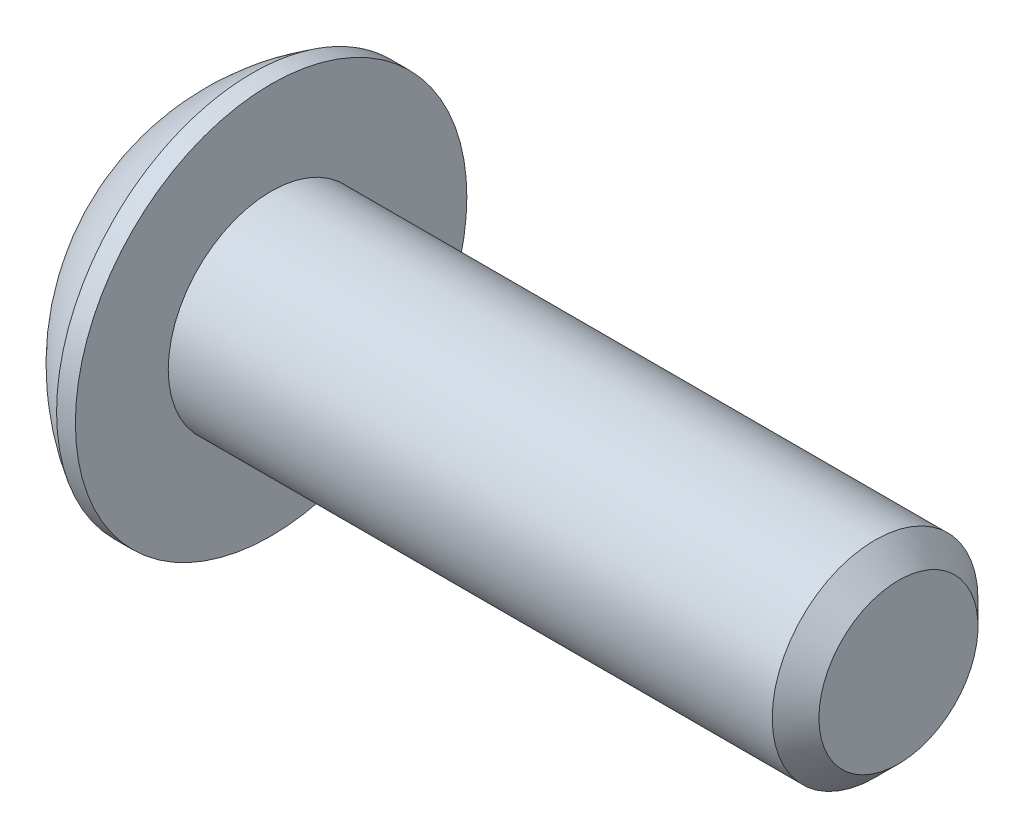
ISO-10303-21;
HEADER;
FILE_DESCRIPTION(('STEP AP214'),'2;1');
FILE_NAME('part.step','',(''),(''),'','','');
FILE_SCHEMA(('AUTOMOTIVE_DESIGN { 1 0 10303 214 1 1 1 1 }'));
ENDSEC;
DATA;
#1=APPLICATION_CONTEXT('core data for automotive mechanical design processes');
#2=APPLICATION_PROTOCOL_DEFINITION('international standard','automotive_design',2000,#1);
#3=PRODUCT_CONTEXT('',#1,'mechanical');
#4=PRODUCT('Part','Part','',(#3));
#5=PRODUCT_RELATED_PRODUCT_CATEGORY('part','',(#4));
#6=PRODUCT_DEFINITION_FORMATION('','',#4);
#7=PRODUCT_DEFINITION_CONTEXT('part definition',#1,'design');
#8=PRODUCT_DEFINITION('design','',#6,#7);
#9=PRODUCT_DEFINITION_SHAPE('','',#8);
#10=(LENGTH_UNIT() NAMED_UNIT(*) SI_UNIT(.MILLI.,.METRE.));
#11=(NAMED_UNIT(*) PLANE_ANGLE_UNIT() SI_UNIT($,.RADIAN.));
#12=(NAMED_UNIT(*) SI_UNIT($,.STERADIAN.) SOLID_ANGLE_UNIT());
#13=UNCERTAINTY_MEASURE_WITH_UNIT(LENGTH_MEASURE(1.E-05),#10,'distance_accuracy_value','');
#14=(GEOMETRIC_REPRESENTATION_CONTEXT(3) GLOBAL_UNCERTAINTY_ASSIGNED_CONTEXT((#13)) GLOBAL_UNIT_ASSIGNED_CONTEXT((#10,
#11,#12)) REPRESENTATION_CONTEXT('',''));
#15=CARTESIAN_POINT('',(0.,0.,0.));
#16=DIRECTION('',(0.,0.,1.));
#17=DIRECTION('',(1.,0.,0.));
#18=AXIS2_PLACEMENT_3D('',#15,#16,#17);
#19=CARTESIAN_POINT('',(1.32080000000034,0.,0.));
#20=DIRECTION('',(-1.,0.,0.));
#21=DIRECTION('',(0.,0.,1.));
#22=AXIS2_PLACEMENT_3D('',#19,#20,#21);
#23=CONICAL_SURFACE('',#22,1.1937999999998,1.04719755119608);
#24=CARTESIAN_POINT('',(2.01004075135902,0.,4.44089209850063E-13));
#25=VERTEX_POINT('',#24);
#26=VERTEX_LOOP('',#25);
#27=FACE_BOUND('',#26,.T.);
#28=CARTESIAN_POINT('',(1.32080000000009,0.,0.));
#29=DIRECTION('',(-1.,0.,0.));
#30=DIRECTION('',(0.,0.,1.));
#31=AXIS2_PLACEMENT_3D('',#28,#29,#30);
#32=CIRCLE('',#31,1.19380000000024);
#33=CARTESIAN_POINT('',(1.32080000000004,-1.03386112703797,0.59690000000006));
#34=VERTEX_POINT('',#33);
#35=CARTESIAN_POINT('',(1.32080000000004,0.,1.19380000000012));
#36=VERTEX_POINT('',#35);
#37=EDGE_CURVE('E19',#34,#36,#32,.T.);
#38=ORIENTED_EDGE('',*,*,#37,.T.);
#39=CARTESIAN_POINT('',(1.32080000000009,0.,0.));
#40=DIRECTION('',(-1.,0.,0.));
#41=DIRECTION('',(0.,0.,1.));
#42=AXIS2_PLACEMENT_3D('',#39,#40,#41);
#43=CIRCLE('',#42,1.19380000000024);
#44=CARTESIAN_POINT('',(1.32080000000004,1.03386112703797,0.596900000000061));
#45=VERTEX_POINT('',#44);
#46=EDGE_CURVE('E148',#36,#45,#43,.T.);
#47=ORIENTED_EDGE('',*,*,#46,.T.);
#48=CARTESIAN_POINT('',(1.32080000000009,0.,0.));
#49=DIRECTION('',(-1.,0.,0.));
#50=DIRECTION('',(0.,0.,1.));
#51=AXIS2_PLACEMENT_3D('',#48,#49,#50);
#52=CIRCLE('',#51,1.19380000000024);
#53=CARTESIAN_POINT('',(1.32080000000004,1.03386112703797,-0.596900000000061));
#54=VERTEX_POINT('',#53);
#55=EDGE_CURVE('E476',#45,#54,#52,.T.);
#56=ORIENTED_EDGE('',*,*,#55,.T.);
#57=CARTESIAN_POINT('',(1.32080000000009,0.,0.));
#58=DIRECTION('',(-1.,0.,0.));
#59=DIRECTION('',(0.,0.,1.));
#60=AXIS2_PLACEMENT_3D('',#57,#58,#59);
#61=CIRCLE('',#60,1.19380000000024);
#62=CARTESIAN_POINT('',(1.32080000000004,1.49457637585666E-12,-1.19380000000012));
#63=VERTEX_POINT('',#62);
#64=EDGE_CURVE('E477',#54,#63,#61,.T.);
#65=ORIENTED_EDGE('',*,*,#64,.T.);
#66=CARTESIAN_POINT('',(1.32080000000009,0.,0.));
#67=DIRECTION('',(-1.,0.,0.));
#68=DIRECTION('',(0.,0.,1.));
#69=AXIS2_PLACEMENT_3D('',#66,#67,#68);
#70=CIRCLE('',#69,1.19380000000024);
#71=CARTESIAN_POINT('',(1.32080000000004,-1.03386112703797,-0.59690000000006));
#72=VERTEX_POINT('',#71);
#73=EDGE_CURVE('E92',#63,#72,#70,.T.);
#74=ORIENTED_EDGE('',*,*,#73,.T.);
#75=CARTESIAN_POINT('',(1.32080000000009,0.,0.));
#76=DIRECTION('',(-1.,0.,0.));
#77=DIRECTION('',(0.,0.,1.));
#78=AXIS2_PLACEMENT_3D('',#75,#76,#77);
#79=CIRCLE('',#78,1.19380000000024);
#80=EDGE_CURVE('E88',#72,#34,#79,.T.);
#81=ORIENTED_EDGE('',*,*,#80,.T.);
#82=EDGE_LOOP('',(#38,#47,#56,#65,#74,#81));
#83=FACE_BOUND('',#82,.T.);
#84=ADVANCED_FACE('F16',(#27,#83),#23,.F.);
#85=CARTESIAN_POINT('',(1.3208,-2.06772225407572,-1.1938));
#86=DIRECTION('',(1.,0.,0.));
#87=DIRECTION('',(0.,0.,-1.));
#88=AXIS2_PLACEMENT_3D('',#85,#86,#87);
#89=PLANE('',#88);
#90=DIRECTION('',(0.,0.5,0.866025403784439));
#91=VECTOR('',#90,1.);
#92=CARTESIAN_POINT('',(1.3208,-1.37848150271715,0.));
#93=LINE('',#92,#91);
#94=CARTESIAN_POINT('',(1.3208,-0.689240751358574,1.1938));
#95=VERTEX_POINT('',#94);
#96=EDGE_CURVE('E100',#95,#34,#93,.F.);
#97=ORIENTED_EDGE('',*,*,#96,.F.);
#98=DIRECTION('',(0.,1.,0.));
#99=VECTOR('',#98,1.);
#100=CARTESIAN_POINT('',(1.3208,-0.689240751358574,1.1938));
#101=LINE('',#100,#99);
#102=EDGE_CURVE('E102',#36,#95,#101,.F.);
#103=ORIENTED_EDGE('',*,*,#102,.F.);
#104=ORIENTED_EDGE('',*,*,#37,.F.);
#105=EDGE_LOOP('',(#97,#103,#104));
#106=FACE_BOUND('',#105,.T.);
#107=ADVANCED_FACE('F98',(#106),#89,.F.);
#108=CARTESIAN_POINT('',(1.3208,-2.06772225407572,-1.1938));
#109=DIRECTION('',(1.,0.,0.));
#110=DIRECTION('',(0.,0.,-1.));
#111=AXIS2_PLACEMENT_3D('',#108,#109,#110);
#112=PLANE('',#111);
#113=DIRECTION('',(0.,-0.5,0.866025403784439));
#114=VECTOR('',#113,1.);
#115=CARTESIAN_POINT('',(1.3208,-0.689240751358574,-1.1938));
#116=LINE('',#115,#114);
#117=CARTESIAN_POINT('',(1.3208,-1.37848150271715,0.));
#118=VERTEX_POINT('',#117);
#119=EDGE_CURVE('E108',#118,#72,#116,.F.);
#120=ORIENTED_EDGE('',*,*,#119,.F.);
#121=DIRECTION('',(0.,0.5,0.866025403784439));
#122=VECTOR('',#121,1.);
#123=CARTESIAN_POINT('',(1.3208,-1.37848150271715,0.));
#124=LINE('',#123,#122);
#125=EDGE_CURVE('E105',#34,#118,#124,.F.);
#126=ORIENTED_EDGE('',*,*,#125,.F.);
#127=ORIENTED_EDGE('',*,*,#80,.F.);
#128=EDGE_LOOP('',(#120,#126,#127));
#129=FACE_BOUND('',#128,.T.);
#130=ADVANCED_FACE('F106',(#129),#112,.F.);
#131=CARTESIAN_POINT('',(1.3208,-2.06772225407572,-1.1938));
#132=DIRECTION('',(1.,0.,0.));
#133=DIRECTION('',(0.,0.,-1.));
#134=AXIS2_PLACEMENT_3D('',#131,#132,#133);
#135=PLANE('',#134);
#136=DIRECTION('',(0.,1.,0.));
#137=VECTOR('',#136,1.);
#138=CARTESIAN_POINT('',(1.3208,0.689240751358577,-1.1938));
#139=LINE('',#138,#137);
#140=CARTESIAN_POINT('',(1.3208,-0.689240751358574,-1.1938));
#141=VERTEX_POINT('',#140);
#142=EDGE_CURVE('E447',#141,#63,#139,.T.);
#143=ORIENTED_EDGE('',*,*,#142,.F.);
#144=DIRECTION('',(0.,-0.5,0.866025403784439));
#145=VECTOR('',#144,1.);
#146=CARTESIAN_POINT('',(1.3208,-0.689240751358574,-1.1938));
#147=LINE('',#146,#145);
#148=EDGE_CURVE('E459',#72,#141,#147,.F.);
#149=ORIENTED_EDGE('',*,*,#148,.F.);
#150=ORIENTED_EDGE('',*,*,#73,.F.);
#151=EDGE_LOOP('',(#143,#149,#150));
#152=FACE_BOUND('',#151,.T.);
#153=ADVANCED_FACE('F191',(#152),#135,.F.);
#154=CARTESIAN_POINT('',(1.3208,-2.06772225407572,-1.1938));
#155=DIRECTION('',(1.,0.,0.));
#156=DIRECTION('',(0.,0.,-1.));
#157=AXIS2_PLACEMENT_3D('',#154,#155,#156);
#158=PLANE('',#157);
#159=DIRECTION('',(0.,-0.5,-0.866025403784439));
#160=VECTOR('',#159,1.);
#161=CARTESIAN_POINT('',(1.3208,1.37848150271715,0.));
#162=LINE('',#161,#160);
#163=CARTESIAN_POINT('',(1.3208,0.689240751358577,-1.1938));
#164=VERTEX_POINT('',#163);
#165=EDGE_CURVE('E433',#164,#54,#162,.F.);
#166=ORIENTED_EDGE('',*,*,#165,.F.);
#167=DIRECTION('',(0.,1.,0.));
#168=VECTOR('',#167,1.);
#169=CARTESIAN_POINT('',(1.3208,0.689240751358577,-1.1938));
#170=LINE('',#169,#168);
#171=EDGE_CURVE('E444',#63,#164,#170,.T.);
#172=ORIENTED_EDGE('',*,*,#171,.F.);
#173=ORIENTED_EDGE('',*,*,#64,.F.);
#174=EDGE_LOOP('',(#166,#172,#173));
#175=FACE_BOUND('',#174,.T.);
#176=ADVANCED_FACE('F187',(#175),#158,.F.);
#177=CARTESIAN_POINT('',(1.3208,-2.06772225407572,-1.1938));
#178=DIRECTION('',(1.,0.,0.));
#179=DIRECTION('',(0.,0.,-1.));
#180=AXIS2_PLACEMENT_3D('',#177,#178,#179);
#181=PLANE('',#180);
#182=DIRECTION('',(0.,0.5,-0.866025403784439));
#183=VECTOR('',#182,1.);
#184=CARTESIAN_POINT('',(1.3208,0.689240751358576,1.1938));
#185=LINE('',#184,#183);
#186=CARTESIAN_POINT('',(1.3208,1.37848150271715,0.));
#187=VERTEX_POINT('',#186);
#188=EDGE_CURVE('E412',#187,#45,#185,.F.);
#189=ORIENTED_EDGE('',*,*,#188,.F.);
#190=DIRECTION('',(0.,-0.5,-0.866025403784439));
#191=VECTOR('',#190,1.);
#192=CARTESIAN_POINT('',(1.3208,1.37848150271715,0.));
#193=LINE('',#192,#191);
#194=EDGE_CURVE('E431',#54,#187,#193,.F.);
#195=ORIENTED_EDGE('',*,*,#194,.F.);
#196=ORIENTED_EDGE('',*,*,#55,.F.);
#197=EDGE_LOOP('',(#189,#195,#196));
#198=FACE_BOUND('',#197,.T.);
#199=ADVANCED_FACE('F183',(#198),#181,.F.);
#200=CARTESIAN_POINT('',(1.3208,-2.06772225407572,-1.1938));
#201=DIRECTION('',(1.,0.,0.));
#202=DIRECTION('',(0.,0.,-1.));
#203=AXIS2_PLACEMENT_3D('',#200,#201,#202);
#204=PLANE('',#203);
#205=DIRECTION('',(0.,1.,0.));
#206=VECTOR('',#205,1.);
#207=CARTESIAN_POINT('',(1.3208,-0.689240751358574,1.1938));
#208=LINE('',#207,#206);
#209=CARTESIAN_POINT('',(1.3208,0.689240751358576,1.1938));
#210=VERTEX_POINT('',#209);
#211=EDGE_CURVE('E117',#210,#36,#208,.F.);
#212=ORIENTED_EDGE('',*,*,#211,.F.);
#213=DIRECTION('',(0.,0.5,-0.866025403784439));
#214=VECTOR('',#213,1.);
#215=CARTESIAN_POINT('',(1.3208,0.689240751358576,1.1938));
#216=LINE('',#215,#214);
#217=EDGE_CURVE('E415',#45,#210,#216,.F.);
#218=ORIENTED_EDGE('',*,*,#217,.F.);
#219=ORIENTED_EDGE('',*,*,#46,.F.);
#220=EDGE_LOOP('',(#212,#218,#219));
#221=FACE_BOUND('',#220,.T.);
#222=ADVANCED_FACE('F179',(#221),#204,.F.);
#223=CARTESIAN_POINT('',(1.3208,-0.689240751358574,1.1938));
#224=DIRECTION('',(0.,0.,-1.));
#225=DIRECTION('',(0.,1.,0.));
#226=AXIS2_PLACEMENT_3D('',#223,#224,#225);
#227=PLANE('',#226);
#228=DIRECTION('',(0.,1.,0.));
#229=VECTOR('',#228,1.);
#230=CARTESIAN_POINT('',(0.,0.,1.1938));
#231=LINE('',#230,#229);
#232=CARTESIAN_POINT('',(0.,0.689240751358577,1.1938));
#233=VERTEX_POINT('',#232);
#234=CARTESIAN_POINT('',(0.,-0.689240751358574,1.1938));
#235=VERTEX_POINT('',#234);
#236=EDGE_CURVE('E409',#233,#235,#231,.F.);
#237=ORIENTED_EDGE('',*,*,#236,.F.);
#238=DIRECTION('',(1.,0.,0.));
#239=VECTOR('',#238,1.);
#240=CARTESIAN_POINT('',(1.3208,0.689240751358576,1.1938));
#241=LINE('',#240,#239);
#242=EDGE_CURVE('E421',#210,#233,#241,.F.);
#243=ORIENTED_EDGE('',*,*,#242,.F.);
#244=ORIENTED_EDGE('',*,*,#211,.T.);
#245=ORIENTED_EDGE('',*,*,#102,.T.);
#246=DIRECTION('',(1.,0.,0.));
#247=VECTOR('',#246,1.);
#248=CARTESIAN_POINT('',(1.3208,-0.689240751358574,1.1938));
#249=LINE('',#248,#247);
#250=EDGE_CURVE('E111',#235,#95,#249,.T.);
#251=ORIENTED_EDGE('',*,*,#250,.F.);
#252=EDGE_LOOP('',(#237,#243,#244,#245,#251));
#253=FACE_BOUND('',#252,.T.);
#254=ADVANCED_FACE('F176',(#253),#227,.T.);
#255=CARTESIAN_POINT('',(1.3208,-1.37848150271715,0.));
#256=DIRECTION('',(0.,0.866025403784439,-0.5));
#257=DIRECTION('',(0.,0.5,0.866025403784439));
#258=AXIS2_PLACEMENT_3D('',#255,#256,#257);
#259=PLANE('',#258);
#260=DIRECTION('',(0.,-0.5,-0.866025403784439));
#261=VECTOR('',#260,1.);
#262=CARTESIAN_POINT('',(0.,-0.689240751358574,1.1938));
#263=LINE('',#262,#261);
#264=CARTESIAN_POINT('',(0.,-1.37848150271715,0.));
#265=VERTEX_POINT('',#264);
#266=EDGE_CURVE('E406',#235,#265,#263,.T.);
#267=ORIENTED_EDGE('',*,*,#266,.F.);
#268=ORIENTED_EDGE('',*,*,#250,.T.);
#269=ORIENTED_EDGE('',*,*,#96,.T.);
#270=ORIENTED_EDGE('',*,*,#125,.T.);
#271=DIRECTION('',(1.,0.,0.));
#272=VECTOR('',#271,1.);
#273=CARTESIAN_POINT('',(1.3208,-1.37848150271715,0.));
#274=LINE('',#273,#272);
#275=EDGE_CURVE('E456',#265,#118,#274,.T.);
#276=ORIENTED_EDGE('',*,*,#275,.F.);
#277=EDGE_LOOP('',(#267,#268,#269,#270,#276));
#278=FACE_BOUND('',#277,.T.);
#279=ADVANCED_FACE('F115',(#278),#259,.T.);
#280=CARTESIAN_POINT('',(1.3208,-0.689240751358574,-1.1938));
#281=DIRECTION('',(0.,0.866025403784439,0.5));
#282=DIRECTION('',(0.,-0.5,0.866025403784439));
#283=AXIS2_PLACEMENT_3D('',#280,#281,#282);
#284=PLANE('',#283);
#285=DIRECTION('',(0.,0.5,-0.866025403784439));
#286=VECTOR('',#285,1.);
#287=CARTESIAN_POINT('',(0.,-1.37848150271715,0.));
#288=LINE('',#287,#286);
#289=CARTESIAN_POINT('',(0.,-0.689240751358574,-1.1938));
#290=VERTEX_POINT('',#289);
#291=EDGE_CURVE('E403',#265,#290,#288,.T.);
#292=ORIENTED_EDGE('',*,*,#291,.F.);
#293=ORIENTED_EDGE('',*,*,#275,.T.);
#294=ORIENTED_EDGE('',*,*,#119,.T.);
#295=ORIENTED_EDGE('',*,*,#148,.T.);
#296=DIRECTION('',(1.,0.,0.));
#297=VECTOR('',#296,1.);
#298=CARTESIAN_POINT('',(1.3208,-0.689240751358574,-1.1938));
#299=LINE('',#298,#297);
#300=EDGE_CURVE('E441',#290,#141,#299,.T.);
#301=ORIENTED_EDGE('',*,*,#300,.F.);
#302=EDGE_LOOP('',(#292,#293,#294,#295,#301));
#303=FACE_BOUND('',#302,.T.);
#304=ADVANCED_FACE('F169',(#303),#284,.T.);
#305=CARTESIAN_POINT('',(1.3208,0.689240751358577,-1.1938));
#306=DIRECTION('',(0.,0.,1.));
#307=DIRECTION('',(1.,0.,0.));
#308=AXIS2_PLACEMENT_3D('',#305,#306,#307);
#309=PLANE('',#308);
#310=DIRECTION('',(0.,1.,0.));
#311=VECTOR('',#310,1.);
#312=CARTESIAN_POINT('',(0.,0.,-1.1938));
#313=LINE('',#312,#311);
#314=CARTESIAN_POINT('',(0.,0.689240751358577,-1.1938));
#315=VERTEX_POINT('',#314);
#316=EDGE_CURVE('E400',#290,#315,#313,.T.);
#317=ORIENTED_EDGE('',*,*,#316,.F.);
#318=ORIENTED_EDGE('',*,*,#300,.T.);
#319=ORIENTED_EDGE('',*,*,#142,.T.);
#320=ORIENTED_EDGE('',*,*,#171,.T.);
#321=DIRECTION('',(1.,0.,0.));
#322=VECTOR('',#321,1.);
#323=CARTESIAN_POINT('',(1.3208,0.689240751358577,-1.1938));
#324=LINE('',#323,#322);
#325=EDGE_CURVE('E416',#315,#164,#324,.T.);
#326=ORIENTED_EDGE('',*,*,#325,.F.);
#327=EDGE_LOOP('',(#317,#318,#319,#320,#326));
#328=FACE_BOUND('',#327,.T.);
#329=ADVANCED_FACE('F166',(#328),#309,.T.);
#330=CARTESIAN_POINT('',(1.3208,1.37848150271715,0.));
#331=DIRECTION('',(0.,-0.866025403784439,0.5));
#332=DIRECTION('',(0.,-0.5,-0.866025403784439));
#333=AXIS2_PLACEMENT_3D('',#330,#331,#332);
#334=PLANE('',#333);
#335=DIRECTION('',(0.,0.5,0.866025403784439));
#336=VECTOR('',#335,1.);
#337=CARTESIAN_POINT('',(0.,0.689240751358577,-1.1938));
#338=LINE('',#337,#336);
#339=CARTESIAN_POINT('',(0.,1.37848150271715,0.));
#340=VERTEX_POINT('',#339);
#341=EDGE_CURVE('E397',#315,#340,#338,.T.);
#342=ORIENTED_EDGE('',*,*,#341,.F.);
#343=ORIENTED_EDGE('',*,*,#325,.T.);
#344=ORIENTED_EDGE('',*,*,#165,.T.);
#345=ORIENTED_EDGE('',*,*,#194,.T.);
#346=DIRECTION('',(1.,0.,0.));
#347=VECTOR('',#346,1.);
#348=CARTESIAN_POINT('',(1.3208,1.37848150271715,0.));
#349=LINE('',#348,#347);
#350=EDGE_CURVE('E34',#340,#187,#349,.T.);
#351=ORIENTED_EDGE('',*,*,#350,.F.);
#352=EDGE_LOOP('',(#342,#343,#344,#345,#351));
#353=FACE_BOUND('',#352,.T.);
#354=ADVANCED_FACE('F162',(#353),#334,.T.);
#355=CARTESIAN_POINT('',(1.3208,0.689240751358576,1.1938));
#356=DIRECTION('',(0.,-0.866025403784439,-0.5));
#357=DIRECTION('',(0.,0.5,-0.866025403784439));
#358=AXIS2_PLACEMENT_3D('',#355,#356,#357);
#359=PLANE('',#358);
#360=DIRECTION('',(0.,-0.5,0.866025403784439));
#361=VECTOR('',#360,1.);
#362=CARTESIAN_POINT('',(0.,1.37848150271715,0.));
#363=LINE('',#362,#361);
#364=EDGE_CURVE('E147',#340,#233,#363,.T.);
#365=ORIENTED_EDGE('',*,*,#364,.F.);
#366=ORIENTED_EDGE('',*,*,#350,.T.);
#367=ORIENTED_EDGE('',*,*,#188,.T.);
#368=ORIENTED_EDGE('',*,*,#217,.T.);
#369=ORIENTED_EDGE('',*,*,#242,.T.);
#370=EDGE_LOOP('',(#365,#366,#367,#368,#369));
#371=FACE_BOUND('',#370,.T.);
#372=ADVANCED_FACE('F158',(#371),#359,.T.);
#373=CARTESIAN_POINT('',(0.,0.,0.));
#374=DIRECTION('',(-1.,0.,0.));
#375=DIRECTION('',(0.,0.,1.));
#376=AXIS2_PLACEMENT_3D('',#373,#374,#375);
#377=PLANE('',#376);
#378=ORIENTED_EDGE('',*,*,#341,.T.);
#379=ORIENTED_EDGE('',*,*,#364,.T.);
#380=ORIENTED_EDGE('',*,*,#236,.T.);
#381=ORIENTED_EDGE('',*,*,#266,.T.);
#382=ORIENTED_EDGE('',*,*,#291,.T.);
#383=ORIENTED_EDGE('',*,*,#316,.T.);
#384=EDGE_LOOP('',(#378,#379,#380,#381,#382,#383));
#385=FACE_BOUND('',#384,.T.);
#386=CARTESIAN_POINT('',(0.,1.9812,0.));
#387=CARTESIAN_POINT('',(0.,1.9811996664299,0.0556258831179428));
#388=CARTESIAN_POINT('',(0.,1.97885520380442,0.111261989398606));
#389=CARTESIAN_POINT('',(0.,1.96949260169541,0.222149719830458));
#390=CARTESIAN_POINT('',(0.,1.96247308239605,0.277401225602895));
#391=CARTESIAN_POINT('',(0.,1.94379192841038,0.387209508139747));
#392=CARTESIAN_POINT('',(-1.85325793235264E-13,1.93212292489526,0.441765039546365));
#393=CARTESIAN_POINT('',(1.86344214223505E-13,1.90422331175315,0.549729449347493));
#394=CARTESIAN_POINT('',(6.94543371897454E-13,1.88798900035338,0.603137359208869));
#395=CARTESIAN_POINT('',(1.15501975216981E-12,1.83266214476501,0.760839131321828));
#396=CARTESIAN_POINT('',(0.,1.78690023648845,0.862876433575429));
#397=CARTESIAN_POINT('',(0.,1.67887358150667,1.05780719540872));
#398=CARTESIAN_POINT('',(9.54193214892627E-13,1.6166082074585,1.15070030720801));
#399=CARTESIAN_POINT('',(5.94805591894675E-13,1.51224157140982,1.28116890915697));
#400=CARTESIAN_POINT('',(1.63221293851378E-13,1.4755970394354,1.32320451127026));
#401=CARTESIAN_POINT('',(-1.62196980336157E-13,1.39893832619713,1.40400288695709));
#402=CARTESIAN_POINT('',(0.,1.35892742784698,1.44276877695455));
#403=CARTESIAN_POINT('',(1.14362537325405E-13,1.23416504602197,1.55382272417904));
#404=CARTESIAN_POINT('',(0.,1.14466125559859,1.62089527952111));
#405=CARTESIAN_POINT('',(0.,0.955712144178167,1.7390221808118));
#406=CARTESIAN_POINT('',(0.,0.856267198233564,1.79007713076007));
#407=CARTESIAN_POINT('',(0.,0.650206345910843,1.87477637530954));
#408=CARTESIAN_POINT('',(0.,0.543590516134855,1.90842085586267));
#409=CARTESIAN_POINT('',(0.,0.326226155292018,1.95733039300656));
#410=CARTESIAN_POINT('',(0.,0.21547760215793,1.97259535144288));
#411=CARTESIAN_POINT('',(0.,-0.00701040587544639,1.98431697865418));
#412=CARTESIAN_POINT('',(0.,-0.118749860774734,1.98077364742917));
#413=CARTESIAN_POINT('',(0.,-0.340050178355485,1.95497485623825));
#414=CARTESIAN_POINT('',(0.,-0.449611052668255,1.93271949620218));
#415=CARTESIAN_POINT('',(0.,-0.663431110729174,1.87014138774523));
#416=CARTESIAN_POINT('',(0.,-0.76769023783852,1.82981844635272));
#417=CARTESIAN_POINT('',(0.,-0.968005760719347,1.73219968377096));
#418=CARTESIAN_POINT('',(0.,-1.0640618469811,1.6749032225164));
#419=CARTESIAN_POINT('',(0.,-1.19980276751283,1.57757371205873));
#420=CARTESIAN_POINT('',(0.,-1.24366557129213,1.54322665019466));
#421=CARTESIAN_POINT('',(0.,-1.32838995706696,1.47093063174264));
#422=CARTESIAN_POINT('',(0.,-1.36924860178706,1.43297823102439));
#423=CARTESIAN_POINT('',(0.,-1.48674671849223,1.31419842051173));
#424=CARTESIAN_POINT('',(0.,-1.55842832343237,1.22836221289311));
#425=CARTESIAN_POINT('',(0.,-1.6863396856475,1.04586168272493));
#426=CARTESIAN_POINT('',(0.,-1.7425700302488,0.949197771949774));
#427=CARTESIAN_POINT('',(0.,-1.8141614250401,0.798182600298684));
#428=CARTESIAN_POINT('',(0.,-1.83591780585875,0.746776203847791));
#429=CARTESIAN_POINT('',(0.,-1.87500754181092,0.642341081688636));
#430=CARTESIAN_POINT('',(0.,-1.89234447645404,0.589313708122847));
#431=CARTESIAN_POINT('',(0.,-1.92246053433554,0.482076273028395));
#432=CARTESIAN_POINT('',(0.,-1.93524685475118,0.42786822425751));
#433=CARTESIAN_POINT('',(0.,-1.95620937250494,0.318578151844611));
#434=CARTESIAN_POINT('',(0.,-1.96438692958147,0.263496390912872));
#435=CARTESIAN_POINT('',(0.,-1.97388528284653,0.173607715038558));
#436=CARTESIAN_POINT('',(0.,-1.97662743364426,0.138944718024998));
#437=CARTESIAN_POINT('',(0.,-1.98028489645283,0.0695224782567002));
#438=CARTESIAN_POINT('',(0.,-1.98120020846367,0.0347632355019631));
#439=CARTESIAN_POINT('',(0.,-1.9811996664299,-0.0556258831179437));
#440=CARTESIAN_POINT('',(0.,-1.97885520380442,-0.111261989398607));
#441=CARTESIAN_POINT('',(0.,-1.96949260169541,-0.222149719830459));
#442=CARTESIAN_POINT('',(0.,-1.96247308239605,-0.277401225602897));
#443=CARTESIAN_POINT('',(0.,-1.94379192841039,-0.387209508139749));
#444=CARTESIAN_POINT('',(-1.85269749640691E-13,-1.93212292489526,-0.441765039546367));
#445=CARTESIAN_POINT('',(1.86288125054388E-13,-1.90422331175315,-0.549729449347495));
#446=CARTESIAN_POINT('',(6.94525090263764E-13,-1.88798900035338,-0.603137359208872));
#447=CARTESIAN_POINT('',(1.15505622829081E-12,-1.83266214476501,-0.760839131321831));
#448=CARTESIAN_POINT('',(0.,-1.78690023648845,-0.862876433575431));
#449=CARTESIAN_POINT('',(0.,-1.67887358150667,-1.05780719540872));
#450=CARTESIAN_POINT('',(9.54248812869379E-13,-1.6166082074585,-1.15070030720801));
#451=CARTESIAN_POINT('',(5.94777756479239E-13,-1.51224157140982,-1.28116890915698));
#452=CARTESIAN_POINT('',(1.63138949183833E-13,-1.47559703943539,-1.32320451127027));
#453=CARTESIAN_POINT('',(-1.62114715061273E-13,-1.39893832619713,-1.40400288695709));
#454=CARTESIAN_POINT('',(0.,-1.35892742784699,-1.44276877695455));
#455=CARTESIAN_POINT('',(1.13760489124207E-13,-1.23416504602197,-1.55382272417904));
#456=CARTESIAN_POINT('',(0.,-1.14466125559859,-1.62089527952111));
#457=CARTESIAN_POINT('',(0.,-0.95571214417816,-1.73902218081179));
#458=CARTESIAN_POINT('',(0.,-0.856267198233559,-1.79007713076007));
#459=CARTESIAN_POINT('',(0.,-0.650206345910841,-1.87477637530954));
#460=CARTESIAN_POINT('',(0.,-0.543590516134854,-1.90842085586267));
#461=CARTESIAN_POINT('',(0.,-0.326226155292018,-1.95733039300657));
#462=CARTESIAN_POINT('',(0.,-0.215477602157929,-1.97259535144288));
#463=CARTESIAN_POINT('',(0.,0.0070104058754487,-1.98431697865418));
#464=CARTESIAN_POINT('',(0.,0.118749860774737,-1.98077364742916));
#465=CARTESIAN_POINT('',(0.,0.340050178355489,-1.95497485623824));
#466=CARTESIAN_POINT('',(0.,0.44961105266826,-1.93271949620218));
#467=CARTESIAN_POINT('',(0.,0.663431110729178,-1.87014138774524));
#468=CARTESIAN_POINT('',(0.,0.767690237838524,-1.82981844635272));
#469=CARTESIAN_POINT('',(0.,0.968005760719348,-1.73219968377096));
#470=CARTESIAN_POINT('',(0.,1.0640618469811,-1.67490322251639));
#471=CARTESIAN_POINT('',(0.,1.19980276751283,-1.57757371205873));
#472=CARTESIAN_POINT('',(0.,1.24366557129214,-1.54322665019465));
#473=CARTESIAN_POINT('',(0.,1.32838995706696,-1.47093063174263));
#474=CARTESIAN_POINT('',(0.,1.36924860178706,-1.43297823102439));
#475=CARTESIAN_POINT('',(0.,1.48674671849223,-1.31419842051172));
#476=CARTESIAN_POINT('',(0.,1.55842832343237,-1.22836221289311));
#477=CARTESIAN_POINT('',(0.,1.6863396856475,-1.04586168272492));
#478=CARTESIAN_POINT('',(0.,1.7425700302488,-0.949197771949768));
#479=CARTESIAN_POINT('',(0.,1.8141614250401,-0.798182600298677));
#480=CARTESIAN_POINT('',(0.,1.83591780585875,-0.746776203847785));
#481=CARTESIAN_POINT('',(0.,1.87500754181092,-0.64234108168863));
#482=CARTESIAN_POINT('',(0.,1.89234447645404,-0.589313708122841));
#483=CARTESIAN_POINT('',(0.,1.92246053433555,-0.482076273028389));
#484=CARTESIAN_POINT('',(0.,1.93524685475118,-0.427868224257505));
#485=CARTESIAN_POINT('',(0.,1.95620937250494,-0.318578151844605));
#486=CARTESIAN_POINT('',(0.,1.96438692958147,-0.263496390912866));
#487=CARTESIAN_POINT('',(0.,1.97388528284653,-0.173607715038553));
#488=CARTESIAN_POINT('',(0.,1.97662743364426,-0.138944718024994));
#489=CARTESIAN_POINT('',(0.,1.98028489645283,-0.0695224782566989));
#490=CARTESIAN_POINT('',(0.,1.98120020846367,-0.034763235501963));
#491=CARTESIAN_POINT('',(0.,1.9812,0.));
#492=B_SPLINE_CURVE_WITH_KNOTS('',3,(#386,#387,#388,#389,#390,#391,#392,#393,#394,#395,#396,
#397,#398,#399,#400,#401,#402,#403,#404,#405,#406,#407,#408,#409,#410,#411,#412,#413,#414,#415,
#416,#417,#418,#419,#420,#421,#422,#423,#424,#425,#426,#427,#428,#429,#430,#431,#432,#433,#434,
#435,#436,#437,#438,#439,#440,#441,#442,#443,#444,#445,#446,#447,#448,#449,#450,#451,#452,#453,
#454,#455,#456,#457,#458,#459,#460,#461,#462,#463,#464,#465,#466,#467,#468,#469,#470,#471,#472,
#473,#474,#475,#476,#477,#478,#479,#480,#481,#482,#483,#484,#485,#486,#487,#488,#489,#490,#491),
.UNSPECIFIED.,.T.,.F.,(4,2,2,2,2,2,2,2,2,2,2,2,2,2,2,2,2,2,2,2,2,2,2,2,2,2,2,2,2,2,2,2,2,2,2,2,
2,2,2,2,2,2,2,2,2,2,2,2,2,2,2,2,4),(0.,0.166845646007828,0.333740557374255,0.500901034367693,
0.668197445942386,1.00199278686282,1.33580081809885,1.50292354032982,1.6698851310853,
2.00370118900129,2.33750465770544,2.67130456115909,3.005106247238,3.33890793331696,
3.67270783677065,4.00651130547476,4.34032736339026,4.50728895414554,4.67441167637632,
5.00821970761259,5.34201504853332,5.50931146010827,5.67647193710191,5.84336684846844,
6.0102124944764,6.11448220058334,6.21875190669029,6.38559755269812,6.55249246406454,
6.71965294105798,6.88694935263268,7.22074469355311,7.55455272478915,7.72167544702011,
7.88863703777559,8.22245309569158,8.55625656439573,8.89005646784938,9.2238581539283,
9.55765984000725,9.89145974346094,10.2252632121651,10.5590792700806,10.7260408608358,
10.8931635830666,11.2269716143029,11.5607669552236,11.7280633667986,11.8952238437922,
12.0621187551587,12.2289644011667,12.3332341072736,12.4375038133806),.UNSPECIFIED.);
#493=CARTESIAN_POINT('',(0.,1.9812,0.));
#494=VERTEX_POINT('',#493);
#495=EDGE_CURVE('E139',#494,#494,#492,.T.);
#496=ORIENTED_EDGE('',*,*,#495,.F.);
#497=EDGE_LOOP('',(#496));
#498=FACE_BOUND('',#497,.T.);
#499=ADVANCED_FACE('F154',(#385,#498),#377,.T.);
#500=CARTESIAN_POINT('',(4.13385,0.,0.));
#501=DIRECTION('',(0.,1.,0.));
#502=DIRECTION('',(1.,0.,0.));
#503=AXIS2_PLACEMENT_3D('',#500,#501,#502);
#504=SPHERICAL_SURFACE('',#503,4.58408870578439);
#505=CARTESIAN_POINT('',(1.8288,0.,0.));
#506=DIRECTION('',(-1.,0.,0.));
#507=DIRECTION('',(0.,0.,1.));
#508=AXIS2_PLACEMENT_3D('',#505,#506,#507);
#509=CIRCLE('',#508,3.9624);
#510=CARTESIAN_POINT('',(1.8288,0.,3.9624));
#511=VERTEX_POINT('',#510);
#512=EDGE_CURVE('E136',#511,#511,#509,.F.);
#513=ORIENTED_EDGE('',*,*,#512,.F.);
#514=EDGE_LOOP('',(#513));
#515=FACE_BOUND('',#514,.T.);
#516=ORIENTED_EDGE('',*,*,#495,.T.);
#517=EDGE_LOOP('',(#516));
#518=FACE_BOUND('',#517,.T.);
#519=ADVANCED_FACE('F150',(#515,#518),#504,.T.);
#520=CARTESIAN_POINT('',(14.9098,0.,0.));
#521=DIRECTION('',(-1.,0.,0.));
#522=DIRECTION('',(0.,0.,1.));
#523=AXIS2_PLACEMENT_3D('',#520,#521,#522);
#524=PLANE('',#523);
#525=CARTESIAN_POINT('',(14.9098000000549,0.,0.));
#526=DIRECTION('',(-1.,0.,0.));
#527=DIRECTION('',(0.,0.,1.));
#528=AXIS2_PLACEMENT_3D('',#525,#526,#527);
#529=CIRCLE('',#528,1.61035999997239);
#530=CARTESIAN_POINT('',(14.9098000000549,0.,1.61035999997239));
#531=VERTEX_POINT('',#530);
#532=EDGE_CURVE('E133',#531,#531,#529,.T.);
#533=ORIENTED_EDGE('',*,*,#532,.F.);
#534=EDGE_LOOP('',(#533));
#535=FACE_BOUND('',#534,.T.);
#536=ADVANCED_FACE('F221',(#535),#524,.F.);
#537=CARTESIAN_POINT('',(0.,0.,0.));
#538=DIRECTION('',(-1.,0.,0.));
#539=DIRECTION('',(0.,0.,1.));
#540=AXIS2_PLACEMENT_3D('',#537,#538,#539);
#541=CYLINDRICAL_SURFACE('',#540,3.9624);
#542=ORIENTED_EDGE('',*,*,#512,.T.);
#543=EDGE_LOOP('',(#542));
#544=FACE_BOUND('',#543,.T.);
#545=CARTESIAN_POINT('',(2.2098,0.,0.));
#546=DIRECTION('',(-1.,0.,0.));
#547=DIRECTION('',(0.,0.,1.));
#548=AXIS2_PLACEMENT_3D('',#545,#546,#547);
#549=CIRCLE('',#548,3.9624);
#550=CARTESIAN_POINT('',(2.2098,0.,3.9624));
#551=VERTEX_POINT('',#550);
#552=EDGE_CURVE('E130',#551,#551,#549,.T.);
#553=ORIENTED_EDGE('',*,*,#552,.T.);
#554=EDGE_LOOP('',(#553));
#555=FACE_BOUND('',#554,.T.);
#556=ADVANCED_FACE('F218',(#544,#555),#541,.T.);
#557=CARTESIAN_POINT('',(14.4373599999881,0.,0.));
#558=DIRECTION('',(-1.,0.,0.));
#559=DIRECTION('',(0.,0.,1.));
#560=AXIS2_PLACEMENT_3D('',#557,#558,#559);
#561=CONICAL_SURFACE('',#560,2.08280000003924,0.785398163397448);
#562=CARTESIAN_POINT('',(14.43736,0.,0.));
#563=DIRECTION('',(-1.,0.,0.));
#564=DIRECTION('',(0.,0.,1.));
#565=AXIS2_PLACEMENT_3D('',#562,#563,#564);
#566=CIRCLE('',#565,2.0828);
#567=CARTESIAN_POINT('',(14.43736,0.,2.0828));
#568=VERTEX_POINT('',#567);
#569=EDGE_CURVE('E25',#568,#568,#566,.T.);
#570=ORIENTED_EDGE('',*,*,#569,.F.);
#571=EDGE_LOOP('',(#570));
#572=FACE_BOUND('',#571,.T.);
#573=ORIENTED_EDGE('',*,*,#532,.T.);
#574=EDGE_LOOP('',(#573));
#575=FACE_BOUND('',#574,.T.);
#576=ADVANCED_FACE('F211',(#572,#575),#561,.T.);
#577=CARTESIAN_POINT('',(2.2098,2.0828,0.));
#578=DIRECTION('',(-1.,0.,0.));
#579=DIRECTION('',(0.,0.,1.));
#580=AXIS2_PLACEMENT_3D('',#577,#578,#579);
#581=PLANE('',#580);
#582=CARTESIAN_POINT('',(2.2098,0.,0.));
#583=DIRECTION('',(-1.,0.,0.));
#584=DIRECTION('',(0.,0.,1.));
#585=AXIS2_PLACEMENT_3D('',#582,#583,#584);
#586=CIRCLE('',#585,2.0828);
#587=CARTESIAN_POINT('',(2.2098,0.,2.0828));
#588=VERTEX_POINT('',#587);
#589=EDGE_CURVE('E11',#588,#588,#586,.F.);
#590=ORIENTED_EDGE('',*,*,#589,.F.);
#591=EDGE_LOOP('',(#590));
#592=FACE_BOUND('',#591,.T.);
#593=ORIENTED_EDGE('',*,*,#552,.F.);
#594=EDGE_LOOP('',(#593));
#595=FACE_BOUND('',#594,.T.);
#596=ADVANCED_FACE('F205',(#592,#595),#581,.F.);
#597=CARTESIAN_POINT('',(0.,0.,0.));
#598=DIRECTION('',(-1.,0.,0.));
#599=DIRECTION('',(0.,0.,1.));
#600=AXIS2_PLACEMENT_3D('',#597,#598,#599);
#601=CYLINDRICAL_SURFACE('',#600,2.0828);
#602=ORIENTED_EDGE('',*,*,#589,.T.);
#603=EDGE_LOOP('',(#602));
#604=FACE_BOUND('',#603,.T.);
#605=ORIENTED_EDGE('',*,*,#569,.T.);
#606=EDGE_LOOP('',(#605));
#607=FACE_BOUND('',#606,.T.);
#608=ADVANCED_FACE('F203',(#604,#607),#601,.T.);
#609=CLOSED_SHELL('',(#84,#107,#130,#153,#176,#199,#222,#254,#279,#304,#329,#354,#372,#499,#519,
#536,#556,#576,#596,#608));
#610=MANIFOLD_SOLID_BREP('B1',#609);
#611=ADVANCED_BREP_SHAPE_REPRESENTATION('',(#18,#610),#14);
#612=SHAPE_DEFINITION_REPRESENTATION(#9,#611);
ENDSEC;
END-ISO-10303-21;
